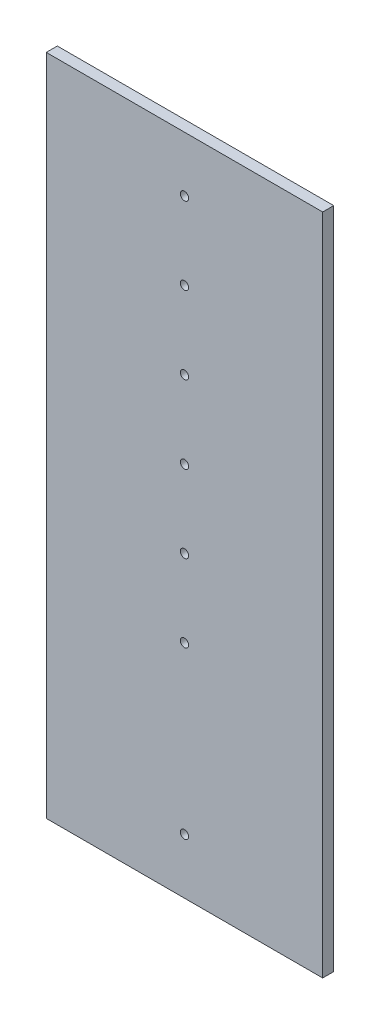
ISO-10303-21;
HEADER;
FILE_DESCRIPTION(('STEP AP214'),'2;1');
FILE_NAME('part.step','',(''),(''),'','','');
FILE_SCHEMA(('AUTOMOTIVE_DESIGN { 1 0 10303 214 1 1 1 1 }'));
ENDSEC;
DATA;
#1=APPLICATION_CONTEXT('core data for automotive mechanical design processes');
#2=APPLICATION_PROTOCOL_DEFINITION('international standard','automotive_design',2000,#1);
#3=PRODUCT_CONTEXT('',#1,'mechanical');
#4=PRODUCT('Part','Part','',(#3));
#5=PRODUCT_RELATED_PRODUCT_CATEGORY('part','',(#4));
#6=PRODUCT_DEFINITION_FORMATION('','',#4);
#7=PRODUCT_DEFINITION_CONTEXT('part definition',#1,'design');
#8=PRODUCT_DEFINITION('design','',#6,#7);
#9=PRODUCT_DEFINITION_SHAPE('','',#8);
#10=(LENGTH_UNIT() NAMED_UNIT(*) SI_UNIT(.MILLI.,.METRE.));
#11=(NAMED_UNIT(*) PLANE_ANGLE_UNIT() SI_UNIT($,.RADIAN.));
#12=(NAMED_UNIT(*) SI_UNIT($,.STERADIAN.) SOLID_ANGLE_UNIT());
#13=UNCERTAINTY_MEASURE_WITH_UNIT(LENGTH_MEASURE(1.E-05),#10,'distance_accuracy_value','');
#14=(GEOMETRIC_REPRESENTATION_CONTEXT(3) GLOBAL_UNCERTAINTY_ASSIGNED_CONTEXT((#13)) GLOBAL_UNIT_ASSIGNED_CONTEXT((#10,
#11,#12)) REPRESENTATION_CONTEXT('',''));
#15=CARTESIAN_POINT('',(0.,0.,0.));
#16=DIRECTION('',(0.,0.,1.));
#17=DIRECTION('',(1.,0.,0.));
#18=AXIS2_PLACEMENT_3D('',#15,#16,#17);
#19=CARTESIAN_POINT('',(0.,120.,2.));
#20=DIRECTION('',(0.,1.,0.));
#21=DIRECTION('',(0.,0.,1.));
#22=AXIS2_PLACEMENT_3D('',#19,#20,#21);
#23=PLANE('',#22);
#24=DIRECTION('',(1.,0.,0.));
#25=VECTOR('',#24,1.);
#26=CARTESIAN_POINT('',(0.,120.,0.));
#27=LINE('',#26,#25);
#28=CARTESIAN_POINT('',(0.,120.,0.));
#29=VERTEX_POINT('',#28);
#30=CARTESIAN_POINT('',(50.,120.,0.));
#31=VERTEX_POINT('',#30);
#32=EDGE_CURVE('E109',#29,#31,#27,.T.);
#33=ORIENTED_EDGE('',*,*,#32,.F.);
#34=DIRECTION('',(0.,0.,-1.));
#35=VECTOR('',#34,1.);
#36=CARTESIAN_POINT('',(0.,120.,2.));
#37=LINE('',#36,#35);
#38=CARTESIAN_POINT('',(0.,120.,2.));
#39=VERTEX_POINT('',#38);
#40=EDGE_CURVE('E11',#39,#29,#37,.T.);
#41=ORIENTED_EDGE('',*,*,#40,.F.);
#42=DIRECTION('',(1.,0.,0.));
#43=VECTOR('',#42,1.);
#44=CARTESIAN_POINT('',(0.,120.,2.));
#45=LINE('',#44,#43);
#46=CARTESIAN_POINT('',(50.,120.,2.));
#47=VERTEX_POINT('',#46);
#48=EDGE_CURVE('E100',#39,#47,#45,.T.);
#49=ORIENTED_EDGE('',*,*,#48,.T.);
#50=DIRECTION('',(0.,0.,-1.));
#51=VECTOR('',#50,1.);
#52=CARTESIAN_POINT('',(50.,120.,2.));
#53=LINE('',#52,#51);
#54=EDGE_CURVE('E41',#47,#31,#53,.T.);
#55=ORIENTED_EDGE('',*,*,#54,.T.);
#56=EDGE_LOOP('',(#33,#41,#49,#55));
#57=FACE_BOUND('',#56,.T.);
#58=ADVANCED_FACE('F38',(#57),#23,.T.);
#59=CARTESIAN_POINT('',(0.,0.,2.));
#60=DIRECTION('',(-1.,0.,0.));
#61=DIRECTION('',(0.,0.,1.));
#62=AXIS2_PLACEMENT_3D('',#59,#60,#61);
#63=PLANE('',#62);
#64=DIRECTION('',(0.,1.,0.));
#65=VECTOR('',#64,1.);
#66=CARTESIAN_POINT('',(0.,0.,0.));
#67=LINE('',#66,#65);
#68=CARTESIAN_POINT('',(0.,0.,0.));
#69=VERTEX_POINT('',#68);
#70=EDGE_CURVE('E103',#69,#29,#67,.T.);
#71=ORIENTED_EDGE('',*,*,#70,.F.);
#72=DIRECTION('',(0.,0.,-1.));
#73=VECTOR('',#72,1.);
#74=CARTESIAN_POINT('',(0.,0.,2.));
#75=LINE('',#74,#73);
#76=CARTESIAN_POINT('',(0.,0.,2.));
#77=VERTEX_POINT('',#76);
#78=EDGE_CURVE('E48',#77,#69,#75,.T.);
#79=ORIENTED_EDGE('',*,*,#78,.F.);
#80=DIRECTION('',(0.,1.,0.));
#81=VECTOR('',#80,1.);
#82=CARTESIAN_POINT('',(0.,0.,2.));
#83=LINE('',#82,#81);
#84=EDGE_CURVE('E87',#77,#39,#83,.T.);
#85=ORIENTED_EDGE('',*,*,#84,.T.);
#86=ORIENTED_EDGE('',*,*,#40,.T.);
#87=EDGE_LOOP('',(#71,#79,#85,#86));
#88=FACE_BOUND('',#87,.T.);
#89=ADVANCED_FACE('F126',(#88),#63,.T.);
#90=CARTESIAN_POINT('',(0.,0.,2.));
#91=DIRECTION('',(0.,1.,0.));
#92=DIRECTION('',(0.,0.,1.));
#93=AXIS2_PLACEMENT_3D('',#90,#91,#92);
#94=PLANE('',#93);
#95=DIRECTION('',(1.,0.,0.));
#96=VECTOR('',#95,1.);
#97=CARTESIAN_POINT('',(0.,0.,0.));
#98=LINE('',#97,#96);
#99=CARTESIAN_POINT('',(50.,0.,0.));
#100=VERTEX_POINT('',#99);
#101=EDGE_CURVE('E93',#69,#100,#98,.T.);
#102=ORIENTED_EDGE('',*,*,#101,.T.);
#103=DIRECTION('',(0.,0.,-1.));
#104=VECTOR('',#103,1.);
#105=CARTESIAN_POINT('',(50.,0.,2.));
#106=LINE('',#105,#104);
#107=CARTESIAN_POINT('',(50.,0.,2.));
#108=VERTEX_POINT('',#107);
#109=EDGE_CURVE('E91',#108,#100,#106,.T.);
#110=ORIENTED_EDGE('',*,*,#109,.F.);
#111=DIRECTION('',(1.,0.,0.));
#112=VECTOR('',#111,1.);
#113=CARTESIAN_POINT('',(0.,0.,2.));
#114=LINE('',#113,#112);
#115=EDGE_CURVE('E84',#77,#108,#114,.T.);
#116=ORIENTED_EDGE('',*,*,#115,.F.);
#117=ORIENTED_EDGE('',*,*,#78,.T.);
#118=EDGE_LOOP('',(#102,#110,#116,#117));
#119=FACE_BOUND('',#118,.T.);
#120=ADVANCED_FACE('F92',(#119),#94,.F.);
#121=CARTESIAN_POINT('',(50.,0.,2.));
#122=DIRECTION('',(-1.,0.,0.));
#123=DIRECTION('',(0.,0.,1.));
#124=AXIS2_PLACEMENT_3D('',#121,#122,#123);
#125=PLANE('',#124);
#126=DIRECTION('',(0.,1.,0.));
#127=VECTOR('',#126,1.);
#128=CARTESIAN_POINT('',(50.,0.,0.));
#129=LINE('',#128,#127);
#130=EDGE_CURVE('E113',#100,#31,#129,.T.);
#131=ORIENTED_EDGE('',*,*,#130,.T.);
#132=ORIENTED_EDGE('',*,*,#54,.F.);
#133=DIRECTION('',(0.,1.,0.));
#134=VECTOR('',#133,1.);
#135=CARTESIAN_POINT('',(50.,0.,2.));
#136=LINE('',#135,#134);
#137=EDGE_CURVE('E81',#108,#47,#136,.T.);
#138=ORIENTED_EDGE('',*,*,#137,.F.);
#139=ORIENTED_EDGE('',*,*,#109,.T.);
#140=EDGE_LOOP('',(#131,#132,#138,#139));
#141=FACE_BOUND('',#140,.T.);
#142=ADVANCED_FACE('F98',(#141),#125,.F.);
#143=CARTESIAN_POINT('',(0.,0.,2.));
#144=DIRECTION('',(0.,0.,1.));
#145=DIRECTION('',(1.,0.,0.));
#146=AXIS2_PLACEMENT_3D('',#143,#144,#145);
#147=PLANE('',#146);
#148=CARTESIAN_POINT('',(25.,110.,2.));
#149=DIRECTION('',(0.,0.,1.));
#150=DIRECTION('',(1.,0.,0.));
#151=AXIS2_PLACEMENT_3D('',#148,#149,#150);
#152=CIRCLE('',#151,0.750000000000002);
#153=CARTESIAN_POINT('',(25.75,110.,2.));
#154=VERTEX_POINT('',#153);
#155=EDGE_CURVE('E114',#154,#154,#152,.T.);
#156=ORIENTED_EDGE('',*,*,#155,.F.);
#157=EDGE_LOOP('',(#156));
#158=FACE_BOUND('',#157,.T.);
#159=CARTESIAN_POINT('',(25.,96.,2.));
#160=DIRECTION('',(0.,0.,1.));
#161=DIRECTION('',(1.,0.,0.));
#162=AXIS2_PLACEMENT_3D('',#159,#160,#161);
#163=CIRCLE('',#162,0.750000000000002);
#164=CARTESIAN_POINT('',(25.75,96.,2.));
#165=VERTEX_POINT('',#164);
#166=EDGE_CURVE('E183',#165,#165,#163,.T.);
#167=ORIENTED_EDGE('',*,*,#166,.F.);
#168=EDGE_LOOP('',(#167));
#169=FACE_BOUND('',#168,.T.);
#170=CARTESIAN_POINT('',(25.,82.,2.));
#171=DIRECTION('',(0.,0.,1.));
#172=DIRECTION('',(1.,0.,0.));
#173=AXIS2_PLACEMENT_3D('',#170,#171,#172);
#174=CIRCLE('',#173,0.750000000000002);
#175=CARTESIAN_POINT('',(25.75,82.,2.));
#176=VERTEX_POINT('',#175);
#177=EDGE_CURVE('E195',#176,#176,#174,.T.);
#178=ORIENTED_EDGE('',*,*,#177,.F.);
#179=EDGE_LOOP('',(#178));
#180=FACE_BOUND('',#179,.T.);
#181=CARTESIAN_POINT('',(25.,68.,2.));
#182=DIRECTION('',(0.,0.,1.));
#183=DIRECTION('',(1.,0.,0.));
#184=AXIS2_PLACEMENT_3D('',#181,#182,#183);
#185=CIRCLE('',#184,0.750000000000002);
#186=CARTESIAN_POINT('',(25.75,68.,2.));
#187=VERTEX_POINT('',#186);
#188=EDGE_CURVE('E203',#187,#187,#185,.T.);
#189=ORIENTED_EDGE('',*,*,#188,.F.);
#190=EDGE_LOOP('',(#189));
#191=FACE_BOUND('',#190,.T.);
#192=CARTESIAN_POINT('',(25.,54.,2.));
#193=DIRECTION('',(0.,0.,1.));
#194=DIRECTION('',(1.,0.,0.));
#195=AXIS2_PLACEMENT_3D('',#192,#193,#194);
#196=CIRCLE('',#195,0.750000000000002);
#197=CARTESIAN_POINT('',(25.75,54.,2.));
#198=VERTEX_POINT('',#197);
#199=EDGE_CURVE('E211',#198,#198,#196,.T.);
#200=ORIENTED_EDGE('',*,*,#199,.F.);
#201=EDGE_LOOP('',(#200));
#202=FACE_BOUND('',#201,.T.);
#203=CARTESIAN_POINT('',(25.,40.,2.));
#204=DIRECTION('',(0.,0.,1.));
#205=DIRECTION('',(1.,0.,0.));
#206=AXIS2_PLACEMENT_3D('',#203,#204,#205);
#207=CIRCLE('',#206,0.750000000000002);
#208=CARTESIAN_POINT('',(25.75,40.,2.));
#209=VERTEX_POINT('',#208);
#210=EDGE_CURVE('E219',#209,#209,#207,.T.);
#211=ORIENTED_EDGE('',*,*,#210,.F.);
#212=EDGE_LOOP('',(#211));
#213=FACE_BOUND('',#212,.T.);
#214=CARTESIAN_POINT('',(25.,10.,2.));
#215=DIRECTION('',(0.,0.,1.));
#216=DIRECTION('',(1.,0.,0.));
#217=AXIS2_PLACEMENT_3D('',#214,#215,#216);
#218=CIRCLE('',#217,0.750000000000002);
#219=CARTESIAN_POINT('',(25.75,10.,2.));
#220=VERTEX_POINT('',#219);
#221=EDGE_CURVE('E227',#220,#220,#218,.T.);
#222=ORIENTED_EDGE('',*,*,#221,.F.);
#223=EDGE_LOOP('',(#222));
#224=FACE_BOUND('',#223,.T.);
#225=ORIENTED_EDGE('',*,*,#48,.F.);
#226=ORIENTED_EDGE('',*,*,#84,.F.);
#227=ORIENTED_EDGE('',*,*,#115,.T.);
#228=ORIENTED_EDGE('',*,*,#137,.T.);
#229=EDGE_LOOP('',(#225,#226,#227,#228));
#230=FACE_BOUND('',#229,.T.);
#231=ADVANCED_FACE('F86',(#158,#169,#180,#191,#202,#213,#224,#230),#147,.T.);
#232=CARTESIAN_POINT('',(0.,0.,0.));
#233=DIRECTION('',(0.,0.,1.));
#234=DIRECTION('',(1.,0.,0.));
#235=AXIS2_PLACEMENT_3D('',#232,#233,#234);
#236=PLANE('',#235);
#237=CARTESIAN_POINT('',(25.,110.,0.));
#238=DIRECTION('',(0.,0.,1.));
#239=DIRECTION('',(1.,0.,0.));
#240=AXIS2_PLACEMENT_3D('',#237,#238,#239);
#241=CIRCLE('',#240,0.750000000000002);
#242=CARTESIAN_POINT('',(25.75,110.,0.));
#243=VERTEX_POINT('',#242);
#244=EDGE_CURVE('E181',#243,#243,#241,.T.);
#245=ORIENTED_EDGE('',*,*,#244,.T.);
#246=EDGE_LOOP('',(#245));
#247=FACE_BOUND('',#246,.T.);
#248=CARTESIAN_POINT('',(25.,96.,0.));
#249=DIRECTION('',(0.,0.,1.));
#250=DIRECTION('',(1.,0.,0.));
#251=AXIS2_PLACEMENT_3D('',#248,#249,#250);
#252=CIRCLE('',#251,0.750000000000002);
#253=CARTESIAN_POINT('',(25.75,96.,0.));
#254=VERTEX_POINT('',#253);
#255=EDGE_CURVE('E189',#254,#254,#252,.T.);
#256=ORIENTED_EDGE('',*,*,#255,.T.);
#257=EDGE_LOOP('',(#256));
#258=FACE_BOUND('',#257,.T.);
#259=CARTESIAN_POINT('',(25.,82.,0.));
#260=DIRECTION('',(0.,0.,1.));
#261=DIRECTION('',(1.,0.,0.));
#262=AXIS2_PLACEMENT_3D('',#259,#260,#261);
#263=CIRCLE('',#262,0.750000000000002);
#264=CARTESIAN_POINT('',(25.75,82.,0.));
#265=VERTEX_POINT('',#264);
#266=EDGE_CURVE('E199',#265,#265,#263,.T.);
#267=ORIENTED_EDGE('',*,*,#266,.T.);
#268=EDGE_LOOP('',(#267));
#269=FACE_BOUND('',#268,.T.);
#270=CARTESIAN_POINT('',(25.,68.,0.));
#271=DIRECTION('',(0.,0.,1.));
#272=DIRECTION('',(1.,0.,0.));
#273=AXIS2_PLACEMENT_3D('',#270,#271,#272);
#274=CIRCLE('',#273,0.750000000000002);
#275=CARTESIAN_POINT('',(25.75,68.,0.));
#276=VERTEX_POINT('',#275);
#277=EDGE_CURVE('E207',#276,#276,#274,.T.);
#278=ORIENTED_EDGE('',*,*,#277,.T.);
#279=EDGE_LOOP('',(#278));
#280=FACE_BOUND('',#279,.T.);
#281=CARTESIAN_POINT('',(25.,54.,0.));
#282=DIRECTION('',(0.,0.,1.));
#283=DIRECTION('',(1.,0.,0.));
#284=AXIS2_PLACEMENT_3D('',#281,#282,#283);
#285=CIRCLE('',#284,0.750000000000002);
#286=CARTESIAN_POINT('',(25.75,54.,0.));
#287=VERTEX_POINT('',#286);
#288=EDGE_CURVE('E215',#287,#287,#285,.T.);
#289=ORIENTED_EDGE('',*,*,#288,.T.);
#290=EDGE_LOOP('',(#289));
#291=FACE_BOUND('',#290,.T.);
#292=CARTESIAN_POINT('',(25.,40.,0.));
#293=DIRECTION('',(0.,0.,1.));
#294=DIRECTION('',(1.,0.,0.));
#295=AXIS2_PLACEMENT_3D('',#292,#293,#294);
#296=CIRCLE('',#295,0.750000000000002);
#297=CARTESIAN_POINT('',(25.75,40.,0.));
#298=VERTEX_POINT('',#297);
#299=EDGE_CURVE('E223',#298,#298,#296,.T.);
#300=ORIENTED_EDGE('',*,*,#299,.T.);
#301=EDGE_LOOP('',(#300));
#302=FACE_BOUND('',#301,.T.);
#303=CARTESIAN_POINT('',(25.,10.,0.));
#304=DIRECTION('',(0.,0.,1.));
#305=DIRECTION('',(1.,0.,0.));
#306=AXIS2_PLACEMENT_3D('',#303,#304,#305);
#307=CIRCLE('',#306,0.750000000000002);
#308=CARTESIAN_POINT('',(25.75,10.,0.));
#309=VERTEX_POINT('',#308);
#310=EDGE_CURVE('E230',#309,#309,#307,.T.);
#311=ORIENTED_EDGE('',*,*,#310,.T.);
#312=EDGE_LOOP('',(#311));
#313=FACE_BOUND('',#312,.T.);
#314=ORIENTED_EDGE('',*,*,#32,.T.);
#315=ORIENTED_EDGE('',*,*,#130,.F.);
#316=ORIENTED_EDGE('',*,*,#101,.F.);
#317=ORIENTED_EDGE('',*,*,#70,.T.);
#318=EDGE_LOOP('',(#314,#315,#316,#317));
#319=FACE_BOUND('',#318,.T.);
#320=ADVANCED_FACE('F125',(#247,#258,#269,#280,#291,#302,#313,#319),#236,.F.);
#321=CARTESIAN_POINT('',(25.,10.,2.));
#322=DIRECTION('',(0.,0.,-1.));
#323=DIRECTION('',(-1.,0.,0.));
#324=AXIS2_PLACEMENT_3D('',#321,#322,#323);
#325=CYLINDRICAL_SURFACE('',#324,0.750000000000002);
#326=ORIENTED_EDGE('',*,*,#221,.T.);
#327=EDGE_LOOP('',(#326));
#328=FACE_BOUND('',#327,.T.);
#329=ORIENTED_EDGE('',*,*,#310,.F.);
#330=EDGE_LOOP('',(#329));
#331=FACE_BOUND('',#330,.T.);
#332=ADVANCED_FACE('F144',(#328,#331),#325,.F.);
#333=CARTESIAN_POINT('',(25.,40.,2.));
#334=DIRECTION('',(0.,0.,-1.));
#335=DIRECTION('',(-1.,0.,0.));
#336=AXIS2_PLACEMENT_3D('',#333,#334,#335);
#337=CYLINDRICAL_SURFACE('',#336,0.750000000000002);
#338=ORIENTED_EDGE('',*,*,#210,.T.);
#339=EDGE_LOOP('',(#338));
#340=FACE_BOUND('',#339,.T.);
#341=ORIENTED_EDGE('',*,*,#299,.F.);
#342=EDGE_LOOP('',(#341));
#343=FACE_BOUND('',#342,.T.);
#344=ADVANCED_FACE('F151',(#340,#343),#337,.F.);
#345=CARTESIAN_POINT('',(25.,54.,2.));
#346=DIRECTION('',(0.,0.,-1.));
#347=DIRECTION('',(-1.,0.,0.));
#348=AXIS2_PLACEMENT_3D('',#345,#346,#347);
#349=CYLINDRICAL_SURFACE('',#348,0.750000000000002);
#350=ORIENTED_EDGE('',*,*,#199,.T.);
#351=EDGE_LOOP('',(#350));
#352=FACE_BOUND('',#351,.T.);
#353=ORIENTED_EDGE('',*,*,#288,.F.);
#354=EDGE_LOOP('',(#353));
#355=FACE_BOUND('',#354,.T.);
#356=ADVANCED_FACE('F155',(#352,#355),#349,.F.);
#357=CARTESIAN_POINT('',(25.,68.,2.));
#358=DIRECTION('',(0.,0.,-1.));
#359=DIRECTION('',(-1.,0.,0.));
#360=AXIS2_PLACEMENT_3D('',#357,#358,#359);
#361=CYLINDRICAL_SURFACE('',#360,0.750000000000002);
#362=ORIENTED_EDGE('',*,*,#188,.T.);
#363=EDGE_LOOP('',(#362));
#364=FACE_BOUND('',#363,.T.);
#365=ORIENTED_EDGE('',*,*,#277,.F.);
#366=EDGE_LOOP('',(#365));
#367=FACE_BOUND('',#366,.T.);
#368=ADVANCED_FACE('F159',(#364,#367),#361,.F.);
#369=CARTESIAN_POINT('',(25.,82.,2.));
#370=DIRECTION('',(0.,0.,-1.));
#371=DIRECTION('',(-1.,0.,0.));
#372=AXIS2_PLACEMENT_3D('',#369,#370,#371);
#373=CYLINDRICAL_SURFACE('',#372,0.750000000000002);
#374=ORIENTED_EDGE('',*,*,#177,.T.);
#375=EDGE_LOOP('',(#374));
#376=FACE_BOUND('',#375,.T.);
#377=ORIENTED_EDGE('',*,*,#266,.F.);
#378=EDGE_LOOP('',(#377));
#379=FACE_BOUND('',#378,.T.);
#380=ADVANCED_FACE('F163',(#376,#379),#373,.F.);
#381=CARTESIAN_POINT('',(25.,96.,2.));
#382=DIRECTION('',(0.,0.,-1.));
#383=DIRECTION('',(-1.,0.,0.));
#384=AXIS2_PLACEMENT_3D('',#381,#382,#383);
#385=CYLINDRICAL_SURFACE('',#384,0.750000000000002);
#386=ORIENTED_EDGE('',*,*,#166,.T.);
#387=EDGE_LOOP('',(#386));
#388=FACE_BOUND('',#387,.T.);
#389=ORIENTED_EDGE('',*,*,#255,.F.);
#390=EDGE_LOOP('',(#389));
#391=FACE_BOUND('',#390,.T.);
#392=ADVANCED_FACE('F167',(#388,#391),#385,.F.);
#393=CARTESIAN_POINT('',(25.,110.,2.));
#394=DIRECTION('',(0.,0.,-1.));
#395=DIRECTION('',(-1.,0.,0.));
#396=AXIS2_PLACEMENT_3D('',#393,#394,#395);
#397=CYLINDRICAL_SURFACE('',#396,0.750000000000002);
#398=ORIENTED_EDGE('',*,*,#155,.T.);
#399=EDGE_LOOP('',(#398));
#400=FACE_BOUND('',#399,.T.);
#401=ORIENTED_EDGE('',*,*,#244,.F.);
#402=EDGE_LOOP('',(#401));
#403=FACE_BOUND('',#402,.T.);
#404=ADVANCED_FACE('F171',(#400,#403),#397,.F.);
#405=CLOSED_SHELL('',(#58,#89,#120,#142,#231,#320,#332,#344,#356,#368,#380,#392,#404));
#406=MANIFOLD_SOLID_BREP('B2',#405);
#407=ADVANCED_BREP_SHAPE_REPRESENTATION('',(#18,#406),#14);
#408=SHAPE_DEFINITION_REPRESENTATION(#9,#407);
ENDSEC;
END-ISO-10303-21;
